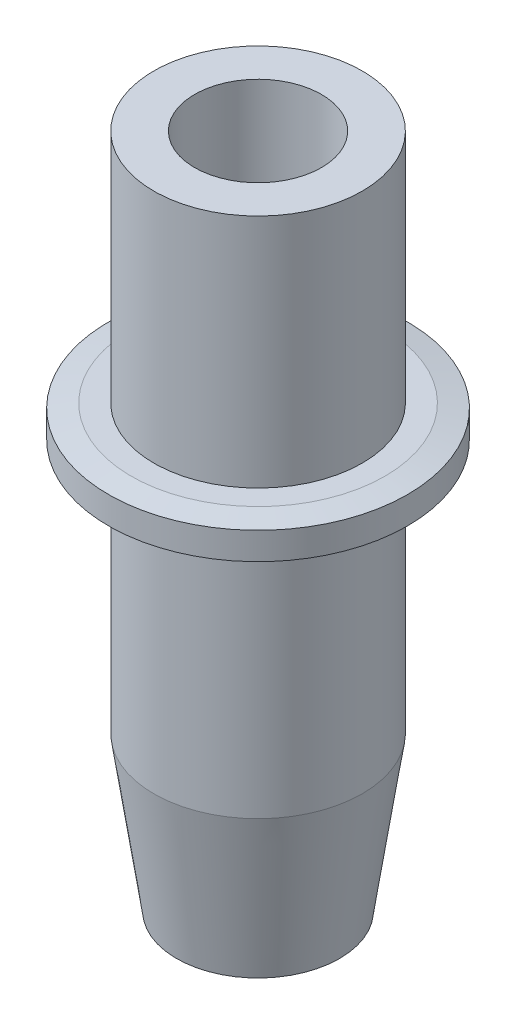
ISO-10303-21;
HEADER;
FILE_DESCRIPTION(('STEP AP214'),'2;1');
FILE_NAME('part.step','',(''),(''),'','','');
FILE_SCHEMA(('AUTOMOTIVE_DESIGN { 1 0 10303 214 1 1 1 1 }'));
ENDSEC;
DATA;
#1=APPLICATION_CONTEXT('core data for automotive mechanical design processes');
#2=APPLICATION_PROTOCOL_DEFINITION('international standard','automotive_design',2000,#1);
#3=PRODUCT_CONTEXT('',#1,'mechanical');
#4=PRODUCT('Part','Part','',(#3));
#5=PRODUCT_RELATED_PRODUCT_CATEGORY('part','',(#4));
#6=PRODUCT_DEFINITION_FORMATION('','',#4);
#7=PRODUCT_DEFINITION_CONTEXT('part definition',#1,'design');
#8=PRODUCT_DEFINITION('design','',#6,#7);
#9=PRODUCT_DEFINITION_SHAPE('','',#8);
#10=(LENGTH_UNIT() NAMED_UNIT(*) SI_UNIT(.MILLI.,.METRE.));
#11=(NAMED_UNIT(*) PLANE_ANGLE_UNIT() SI_UNIT($,.RADIAN.));
#12=(NAMED_UNIT(*) SI_UNIT($,.STERADIAN.) SOLID_ANGLE_UNIT());
#13=UNCERTAINTY_MEASURE_WITH_UNIT(LENGTH_MEASURE(1.E-05),#10,'distance_accuracy_value','');
#14=(GEOMETRIC_REPRESENTATION_CONTEXT(3) GLOBAL_UNCERTAINTY_ASSIGNED_CONTEXT((#13)) GLOBAL_UNIT_ASSIGNED_CONTEXT((#10,
#11,#12)) REPRESENTATION_CONTEXT('',''));
#15=CARTESIAN_POINT('',(0.,0.,0.));
#16=DIRECTION('',(0.,0.,1.));
#17=DIRECTION('',(1.,0.,0.));
#18=AXIS2_PLACEMENT_3D('',#15,#16,#17);
#19=CARTESIAN_POINT('',(0.,0.,0.));
#20=DIRECTION('',(0.,1.,0.));
#21=DIRECTION('',(-1.,0.,0.));
#22=AXIS2_PLACEMENT_3D('',#19,#20,#21);
#23=CONICAL_SURFACE('',#22,4.5,0.146012257711279);
#24=CARTESIAN_POINT('',(0.,8.49999999999998,0.));
#25=DIRECTION('',(0.,-1.,0.));
#26=DIRECTION('',(1.,0.,0.));
#27=AXIS2_PLACEMENT_3D('',#24,#25,#26);
#28=CIRCLE('',#27,5.75000000000003);
#29=CARTESIAN_POINT('',(5.75,8.5,0.));
#30=VERTEX_POINT('',#29);
#31=EDGE_CURVE('E42',#30,#30,#28,.T.);
#32=ORIENTED_EDGE('',*,*,#31,.T.);
#33=EDGE_LOOP('',(#32));
#34=FACE_BOUND('',#33,.T.);
#35=CARTESIAN_POINT('',(0.,0.,0.));
#36=DIRECTION('',(0.,-1.,0.));
#37=DIRECTION('',(1.,0.,0.));
#38=AXIS2_PLACEMENT_3D('',#35,#36,#37);
#39=CIRCLE('',#38,4.5);
#40=CARTESIAN_POINT('',(4.5,0.,0.));
#41=VERTEX_POINT('',#40);
#42=EDGE_CURVE('E69',#41,#41,#39,.T.);
#43=ORIENTED_EDGE('',*,*,#42,.F.);
#44=EDGE_LOOP('',(#43));
#45=FACE_BOUND('',#44,.T.);
#46=ADVANCED_FACE('F31',(#34,#45),#23,.T.);
#47=CARTESIAN_POINT('',(5.02600346399491E-13,-143.950460455854,0.));
#48=DIRECTION('',(0.,-1.,0.));
#49=DIRECTION('',(1.,0.,0.));
#50=AXIS2_PLACEMENT_3D('',#47,#48,#49);
#51=CYLINDRICAL_SURFACE('',#50,5.75000000000005);
#52=CARTESIAN_POINT('',(0.,22.3,0.));
#53=DIRECTION('',(0.,-1.,0.));
#54=DIRECTION('',(1.,0.,0.));
#55=AXIS2_PLACEMENT_3D('',#52,#53,#54);
#56=CIRCLE('',#55,5.75000000000008);
#57=CARTESIAN_POINT('',(5.75,22.3,0.));
#58=VERTEX_POINT('',#57);
#59=EDGE_CURVE('E46',#58,#58,#56,.T.);
#60=ORIENTED_EDGE('',*,*,#59,.T.);
#61=EDGE_LOOP('',(#60));
#62=FACE_BOUND('',#61,.T.);
#63=ORIENTED_EDGE('',*,*,#31,.F.);
#64=EDGE_LOOP('',(#63));
#65=FACE_BOUND('',#64,.T.);
#66=ADVANCED_FACE('F113',(#62,#65),#51,.T.);
#67=CARTESIAN_POINT('',(5.75,22.3,0.));
#68=DIRECTION('',(0.,-1.,0.));
#69=DIRECTION('',(1.,0.,0.));
#70=AXIS2_PLACEMENT_3D('',#67,#68,#69);
#71=PLANE('',#70);
#72=CARTESIAN_POINT('',(0.,22.3,0.));
#73=DIRECTION('',(0.,-1.,0.));
#74=DIRECTION('',(1.,0.,0.));
#75=AXIS2_PLACEMENT_3D('',#72,#73,#74);
#76=CIRCLE('',#75,7.00000000000008);
#77=CARTESIAN_POINT('',(7.,22.3,0.));
#78=VERTEX_POINT('',#77);
#79=EDGE_CURVE('E51',#78,#78,#76,.T.);
#80=ORIENTED_EDGE('',*,*,#79,.T.);
#81=EDGE_LOOP('',(#80));
#82=FACE_BOUND('',#81,.T.);
#83=ORIENTED_EDGE('',*,*,#59,.F.);
#84=EDGE_LOOP('',(#83));
#85=FACE_BOUND('',#84,.T.);
#86=ADVANCED_FACE('F118',(#82,#85),#71,.T.);
#87=CARTESIAN_POINT('',(0.,22.3,0.));
#88=DIRECTION('',(0.,1.,0.));
#89=DIRECTION('',(-1.,0.,0.));
#90=AXIS2_PLACEMENT_3D('',#87,#88,#89);
#91=CONICAL_SURFACE('',#90,7.00000000000008,1.37340076694502);
#92=CARTESIAN_POINT('',(0.,22.55,0.));
#93=DIRECTION('',(0.,-1.,0.));
#94=DIRECTION('',(1.,0.,0.));
#95=AXIS2_PLACEMENT_3D('',#92,#93,#94);
#96=CIRCLE('',#95,8.25000000000008);
#97=CARTESIAN_POINT('',(8.25,22.55,0.));
#98=VERTEX_POINT('',#97);
#99=EDGE_CURVE('E54',#98,#98,#96,.T.);
#100=ORIENTED_EDGE('',*,*,#99,.T.);
#101=EDGE_LOOP('',(#100));
#102=FACE_BOUND('',#101,.T.);
#103=ORIENTED_EDGE('',*,*,#79,.F.);
#104=EDGE_LOOP('',(#103));
#105=FACE_BOUND('',#104,.T.);
#106=ADVANCED_FACE('F125',(#102,#105),#91,.T.);
#107=CARTESIAN_POINT('',(5.02600346399491E-13,-143.950460455854,0.));
#108=DIRECTION('',(0.,-1.,0.));
#109=DIRECTION('',(1.,0.,0.));
#110=AXIS2_PLACEMENT_3D('',#107,#108,#109);
#111=CYLINDRICAL_SURFACE('',#110,8.25000000000008);
#112=CARTESIAN_POINT('',(0.,24.05,0.));
#113=DIRECTION('',(0.,-1.,0.));
#114=DIRECTION('',(1.,0.,0.));
#115=AXIS2_PLACEMENT_3D('',#112,#113,#114);
#116=CIRCLE('',#115,8.25000000000008);
#117=CARTESIAN_POINT('',(8.25,24.05,0.));
#118=VERTEX_POINT('',#117);
#119=EDGE_CURVE('E57',#118,#118,#116,.T.);
#120=ORIENTED_EDGE('',*,*,#119,.T.);
#121=EDGE_LOOP('',(#120));
#122=FACE_BOUND('',#121,.T.);
#123=ORIENTED_EDGE('',*,*,#99,.F.);
#124=EDGE_LOOP('',(#123));
#125=FACE_BOUND('',#124,.T.);
#126=ADVANCED_FACE('F129',(#122,#125),#111,.T.);
#127=CARTESIAN_POINT('',(0.,24.05,0.));
#128=DIRECTION('',(0.,-1.,0.));
#129=DIRECTION('',(1.,0.,0.));
#130=AXIS2_PLACEMENT_3D('',#127,#128,#129);
#131=CONICAL_SURFACE('',#130,8.25000000000008,1.37340076694502);
#132=CARTESIAN_POINT('',(0.,24.3,0.));
#133=DIRECTION('',(0.,-1.,0.));
#134=DIRECTION('',(1.,0.,0.));
#135=AXIS2_PLACEMENT_3D('',#132,#133,#134);
#136=CIRCLE('',#135,7.00000000000009);
#137=CARTESIAN_POINT('',(7.,24.3,0.));
#138=VERTEX_POINT('',#137);
#139=EDGE_CURVE('E60',#138,#138,#136,.T.);
#140=ORIENTED_EDGE('',*,*,#139,.T.);
#141=EDGE_LOOP('',(#140));
#142=FACE_BOUND('',#141,.T.);
#143=ORIENTED_EDGE('',*,*,#119,.F.);
#144=EDGE_LOOP('',(#143));
#145=FACE_BOUND('',#144,.T.);
#146=ADVANCED_FACE('F133',(#142,#145),#131,.T.);
#147=CARTESIAN_POINT('',(7.,24.3,0.));
#148=DIRECTION('',(0.,1.,0.));
#149=DIRECTION('',(-1.,0.,0.));
#150=AXIS2_PLACEMENT_3D('',#147,#148,#149);
#151=PLANE('',#150);
#152=CARTESIAN_POINT('',(0.,24.3,0.));
#153=DIRECTION('',(0.,-1.,0.));
#154=DIRECTION('',(1.,0.,0.));
#155=AXIS2_PLACEMENT_3D('',#152,#153,#154);
#156=CIRCLE('',#155,5.75000000000009);
#157=CARTESIAN_POINT('',(5.75,24.3,0.));
#158=VERTEX_POINT('',#157);
#159=EDGE_CURVE('E63',#158,#158,#156,.T.);
#160=ORIENTED_EDGE('',*,*,#159,.T.);
#161=EDGE_LOOP('',(#160));
#162=FACE_BOUND('',#161,.T.);
#163=ORIENTED_EDGE('',*,*,#139,.F.);
#164=EDGE_LOOP('',(#163));
#165=FACE_BOUND('',#164,.T.);
#166=ADVANCED_FACE('F137',(#162,#165),#151,.T.);
#167=CARTESIAN_POINT('',(5.02600346399491E-13,-143.950460455854,0.));
#168=DIRECTION('',(0.,-1.,0.));
#169=DIRECTION('',(1.,0.,0.));
#170=AXIS2_PLACEMENT_3D('',#167,#168,#169);
#171=CYLINDRICAL_SURFACE('',#170,5.75000000000011);
#172=CARTESIAN_POINT('',(-1.30232253938849E-13,37.3,0.));
#173=DIRECTION('',(0.,-1.,0.));
#174=DIRECTION('',(1.,0.,0.));
#175=AXIS2_PLACEMENT_3D('',#172,#173,#174);
#176=CIRCLE('',#175,5.75000000000013);
#177=CARTESIAN_POINT('',(5.75,37.3,0.));
#178=VERTEX_POINT('',#177);
#179=EDGE_CURVE('E66',#178,#178,#176,.T.);
#180=ORIENTED_EDGE('',*,*,#179,.T.);
#181=EDGE_LOOP('',(#180));
#182=FACE_BOUND('',#181,.T.);
#183=ORIENTED_EDGE('',*,*,#159,.F.);
#184=EDGE_LOOP('',(#183));
#185=FACE_BOUND('',#184,.T.);
#186=ADVANCED_FACE('F141',(#182,#185),#171,.T.);
#187=CARTESIAN_POINT('',(5.75,37.3,0.));
#188=DIRECTION('',(0.,1.,0.));
#189=DIRECTION('',(-1.,0.,0.));
#190=AXIS2_PLACEMENT_3D('',#187,#188,#189);
#191=PLANE('',#190);
#192=CARTESIAN_POINT('',(-1.30232253938848E-13,37.2999999999999,0.));
#193=DIRECTION('',(0.,-1.,0.));
#194=DIRECTION('',(1.,0.,0.));
#195=AXIS2_PLACEMENT_3D('',#192,#193,#194);
#196=CIRCLE('',#195,3.50000000000013);
#197=CARTESIAN_POINT('',(3.5,37.2999999999999,0.));
#198=VERTEX_POINT('',#197);
#199=EDGE_CURVE('E84',#198,#198,#196,.T.);
#200=ORIENTED_EDGE('',*,*,#199,.T.);
#201=EDGE_LOOP('',(#200));
#202=FACE_BOUND('',#201,.T.);
#203=ORIENTED_EDGE('',*,*,#179,.F.);
#204=EDGE_LOOP('',(#203));
#205=FACE_BOUND('',#204,.T.);
#206=ADVANCED_FACE('F88',(#202,#205),#191,.T.);
#207=CARTESIAN_POINT('',(0.,0.,0.));
#208=DIRECTION('',(0.,-1.,0.));
#209=DIRECTION('',(1.,0.,0.));
#210=AXIS2_PLACEMENT_3D('',#207,#208,#209);
#211=PLANE('',#210);
#212=CARTESIAN_POINT('',(0.,0.,0.));
#213=DIRECTION('',(0.,-1.,0.));
#214=DIRECTION('',(1.,0.,0.));
#215=AXIS2_PLACEMENT_3D('',#212,#213,#214);
#216=CIRCLE('',#215,1.1);
#217=CARTESIAN_POINT('',(1.1,0.,0.));
#218=VERTEX_POINT('',#217);
#219=EDGE_CURVE('E72',#218,#218,#216,.T.);
#220=ORIENTED_EDGE('',*,*,#219,.F.);
#221=EDGE_LOOP('',(#220));
#222=FACE_BOUND('',#221,.T.);
#223=ORIENTED_EDGE('',*,*,#42,.T.);
#224=EDGE_LOOP('',(#223));
#225=FACE_BOUND('',#224,.T.);
#226=ADVANCED_FACE('F148',(#222,#225),#211,.T.);
#227=CARTESIAN_POINT('',(3.49148133884313E-12,-1000.,0.));
#228=DIRECTION('',(0.,-1.,0.));
#229=DIRECTION('',(1.,0.,0.));
#230=AXIS2_PLACEMENT_3D('',#227,#228,#229);
#231=CYLINDRICAL_SURFACE('',#230,1.1);
#232=CARTESIAN_POINT('',(0.,2.,0.));
#233=DIRECTION('',(0.,-1.,0.));
#234=DIRECTION('',(1.,0.,0.));
#235=AXIS2_PLACEMENT_3D('',#232,#233,#234);
#236=CIRCLE('',#235,1.10000000000001);
#237=CARTESIAN_POINT('',(1.1,2.00000000000001,0.));
#238=VERTEX_POINT('',#237);
#239=EDGE_CURVE('E75',#238,#238,#236,.T.);
#240=ORIENTED_EDGE('',*,*,#239,.F.);
#241=EDGE_LOOP('',(#240));
#242=FACE_BOUND('',#241,.T.);
#243=ORIENTED_EDGE('',*,*,#219,.T.);
#244=EDGE_LOOP('',(#243));
#245=FACE_BOUND('',#244,.T.);
#246=ADVANCED_FACE('F110',(#242,#245),#231,.F.);
#247=CARTESIAN_POINT('',(1.1,2.,0.));
#248=DIRECTION('',(0.,-1.,0.));
#249=DIRECTION('',(1.,0.,0.));
#250=AXIS2_PLACEMENT_3D('',#247,#248,#249);
#251=PLANE('',#250);
#252=CARTESIAN_POINT('',(0.,1.99999999999999,0.));
#253=DIRECTION('',(0.,-1.,0.));
#254=DIRECTION('',(1.,0.,0.));
#255=AXIS2_PLACEMENT_3D('',#252,#253,#254);
#256=CIRCLE('',#255,1.49999999999985);
#257=CARTESIAN_POINT('',(1.49999999999984,2.,0.));
#258=VERTEX_POINT('',#257);
#259=EDGE_CURVE('E10',#258,#258,#256,.F.);
#260=ORIENTED_EDGE('',*,*,#259,.T.);
#261=EDGE_LOOP('',(#260));
#262=FACE_BOUND('',#261,.T.);
#263=ORIENTED_EDGE('',*,*,#239,.T.);
#264=EDGE_LOOP('',(#263));
#265=FACE_BOUND('',#264,.T.);
#266=ADVANCED_FACE('F105',(#262,#265),#251,.F.);
#267=CARTESIAN_POINT('',(3.49148133884313E-12,-1000.,0.));
#268=DIRECTION('',(0.,-1.,0.));
#269=DIRECTION('',(1.,0.,0.));
#270=AXIS2_PLACEMENT_3D('',#267,#268,#269);
#271=CYLINDRICAL_SURFACE('',#270,2.50000000000003);
#272=CARTESIAN_POINT('',(0.,4.24603677390456,0.));
#273=DIRECTION('',(0.,-1.,0.));
#274=DIRECTION('',(1.,0.,0.));
#275=AXIS2_PLACEMENT_3D('',#272,#273,#274);
#276=CIRCLE('',#275,2.50000000000003);
#277=CARTESIAN_POINT('',(2.50000000000001,4.24603677390457,0.));
#278=VERTEX_POINT('',#277);
#279=EDGE_CURVE('E38',#278,#278,#276,.T.);
#280=ORIENTED_EDGE('',*,*,#279,.T.);
#281=EDGE_LOOP('',(#280));
#282=FACE_BOUND('',#281,.T.);
#283=CARTESIAN_POINT('',(0.,14.1800000000001,0.));
#284=DIRECTION('',(0.,-1.,0.));
#285=DIRECTION('',(1.,0.,0.));
#286=AXIS2_PLACEMENT_3D('',#283,#284,#285);
#287=CIRCLE('',#286,2.50000000000005);
#288=CARTESIAN_POINT('',(2.5,14.1800000000001,0.));
#289=VERTEX_POINT('',#288);
#290=EDGE_CURVE('E78',#289,#289,#287,.T.);
#291=ORIENTED_EDGE('',*,*,#290,.F.);
#292=EDGE_LOOP('',(#291));
#293=FACE_BOUND('',#292,.T.);
#294=ADVANCED_FACE('F100',(#282,#293),#271,.F.);
#295=CARTESIAN_POINT('',(2.5,14.18,0.));
#296=DIRECTION('',(0.,-1.,0.));
#297=DIRECTION('',(1.,0.,0.));
#298=AXIS2_PLACEMENT_3D('',#295,#296,#297);
#299=PLANE('',#298);
#300=CARTESIAN_POINT('',(0.,14.1800000000001,0.));
#301=DIRECTION('',(0.,-1.,0.));
#302=DIRECTION('',(1.,0.,0.));
#303=AXIS2_PLACEMENT_3D('',#300,#301,#302);
#304=CIRCLE('',#303,3.50000000000005);
#305=CARTESIAN_POINT('',(3.5,14.1800000000001,0.));
#306=VERTEX_POINT('',#305);
#307=EDGE_CURVE('E81',#306,#306,#304,.T.);
#308=ORIENTED_EDGE('',*,*,#307,.F.);
#309=EDGE_LOOP('',(#308));
#310=FACE_BOUND('',#309,.T.);
#311=ORIENTED_EDGE('',*,*,#290,.T.);
#312=EDGE_LOOP('',(#311));
#313=FACE_BOUND('',#312,.T.);
#314=ADVANCED_FACE('F94',(#310,#313),#299,.F.);
#315=CARTESIAN_POINT('',(3.49148133884313E-12,-1000.,0.));
#316=DIRECTION('',(0.,-1.,0.));
#317=DIRECTION('',(1.,0.,0.));
#318=AXIS2_PLACEMENT_3D('',#315,#316,#317);
#319=CYLINDRICAL_SURFACE('',#318,3.50000000000009);
#320=ORIENTED_EDGE('',*,*,#199,.F.);
#321=EDGE_LOOP('',(#320));
#322=FACE_BOUND('',#321,.T.);
#323=ORIENTED_EDGE('',*,*,#307,.T.);
#324=EDGE_LOOP('',(#323));
#325=FACE_BOUND('',#324,.T.);
#326=ADVANCED_FACE('F91',(#322,#325),#319,.F.);
#327=CARTESIAN_POINT('',(0.,4.24603677390456,0.));
#328=DIRECTION('',(0.,1.,0.));
#329=DIRECTION('',(-1.,0.,0.));
#330=AXIS2_PLACEMENT_3D('',#327,#328,#329);
#331=CONICAL_SURFACE('',#330,2.50000000000003,0.418879020478647);
#332=ORIENTED_EDGE('',*,*,#259,.F.);
#333=EDGE_LOOP('',(#332));
#334=FACE_BOUND('',#333,.T.);
#335=ORIENTED_EDGE('',*,*,#279,.F.);
#336=EDGE_LOOP('',(#335));
#337=FACE_BOUND('',#336,.T.);
#338=ADVANCED_FACE('F33',(#334,#337),#331,.F.);
#339=CLOSED_SHELL('',(#46,#66,#86,#106,#126,#146,#166,#186,#206,#226,#246,#266,#294,#314,#326,#338));
#340=MANIFOLD_SOLID_BREP('B2',#339);
#341=ADVANCED_BREP_SHAPE_REPRESENTATION('',(#18,#340),#14);
#342=SHAPE_DEFINITION_REPRESENTATION(#9,#341);
ENDSEC;
END-ISO-10303-21;
